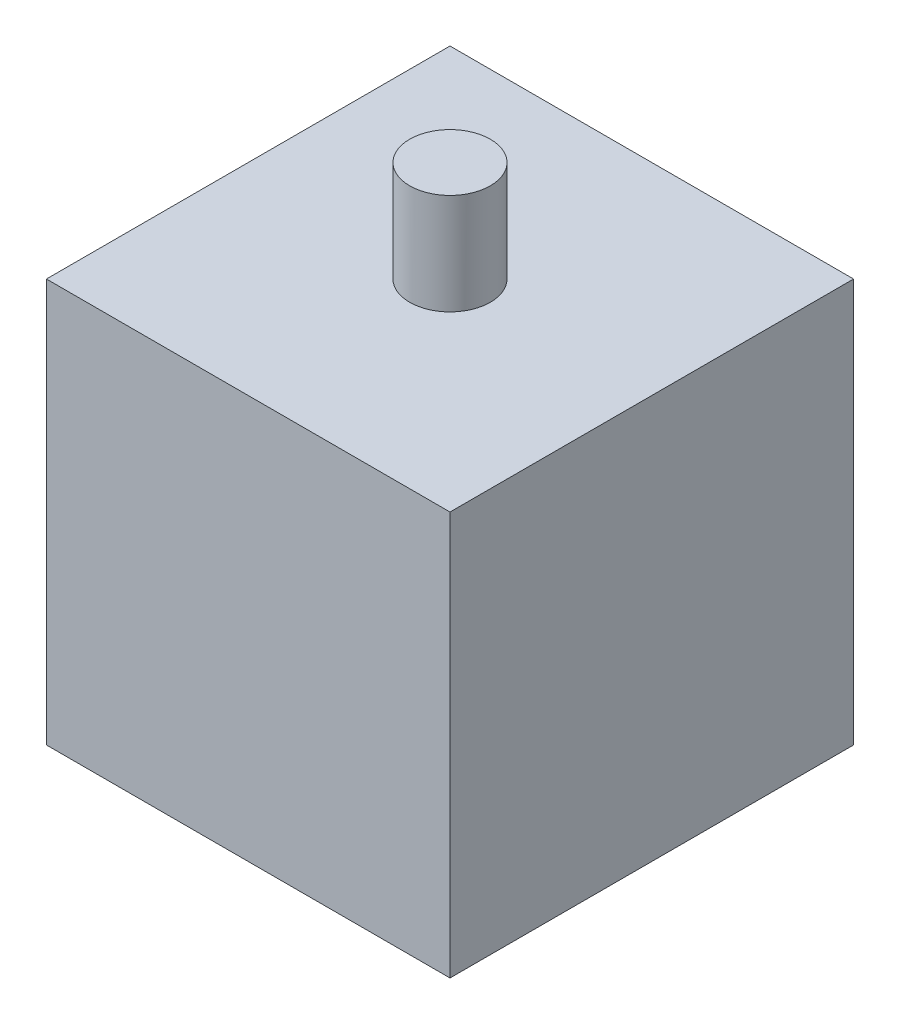
ISO-10303-21;
HEADER;
FILE_DESCRIPTION(('STEP AP214'),'2;1');
FILE_NAME('part.step','',(''),(''),'','','');
FILE_SCHEMA(('AUTOMOTIVE_DESIGN { 1 0 10303 214 1 1 1 1 }'));
ENDSEC;
DATA;
#1=APPLICATION_CONTEXT('core data for automotive mechanical design processes');
#2=APPLICATION_PROTOCOL_DEFINITION('international standard','automotive_design',2000,#1);
#3=PRODUCT_CONTEXT('',#1,'mechanical');
#4=PRODUCT('Part','Part','',(#3));
#5=PRODUCT_RELATED_PRODUCT_CATEGORY('part','',(#4));
#6=PRODUCT_DEFINITION_FORMATION('','',#4);
#7=PRODUCT_DEFINITION_CONTEXT('part definition',#1,'design');
#8=PRODUCT_DEFINITION('design','',#6,#7);
#9=PRODUCT_DEFINITION_SHAPE('','',#8);
#10=(LENGTH_UNIT() NAMED_UNIT(*) SI_UNIT(.MILLI.,.METRE.));
#11=(NAMED_UNIT(*) PLANE_ANGLE_UNIT() SI_UNIT($,.RADIAN.));
#12=(NAMED_UNIT(*) SI_UNIT($,.STERADIAN.) SOLID_ANGLE_UNIT());
#13=UNCERTAINTY_MEASURE_WITH_UNIT(LENGTH_MEASURE(1.E-05),#10,'distance_accuracy_value','');
#14=(GEOMETRIC_REPRESENTATION_CONTEXT(3) GLOBAL_UNCERTAINTY_ASSIGNED_CONTEXT((#13)) GLOBAL_UNIT_ASSIGNED_CONTEXT((#10,
#11,#12)) REPRESENTATION_CONTEXT('',''));
#15=CARTESIAN_POINT('',(0.,0.,0.));
#16=DIRECTION('',(0.,0.,1.));
#17=DIRECTION('',(1.,0.,0.));
#18=AXIS2_PLACEMENT_3D('',#15,#16,#17);
#19=CARTESIAN_POINT('',(0.,100.,0.));
#20=DIRECTION('',(1.,0.,0.));
#21=DIRECTION('',(0.,0.,-1.));
#22=AXIS2_PLACEMENT_3D('',#19,#20,#21);
#23=PLANE('',#22);
#24=DIRECTION('',(0.,0.,1.));
#25=VECTOR('',#24,1.);
#26=CARTESIAN_POINT('',(0.,0.,0.));
#27=LINE('',#26,#25);
#28=CARTESIAN_POINT('',(0.,0.,-100.));
#29=VERTEX_POINT('',#28);
#30=CARTESIAN_POINT('',(0.,0.,0.));
#31=VERTEX_POINT('',#30);
#32=EDGE_CURVE('E107',#29,#31,#27,.T.);
#33=ORIENTED_EDGE('',*,*,#32,.T.);
#34=DIRECTION('',(0.,-1.,0.));
#35=VECTOR('',#34,1.);
#36=CARTESIAN_POINT('',(0.,100.,0.));
#37=LINE('',#36,#35);
#38=CARTESIAN_POINT('',(0.,100.,0.));
#39=VERTEX_POINT('',#38);
#40=EDGE_CURVE('E49',#39,#31,#37,.T.);
#41=ORIENTED_EDGE('',*,*,#40,.F.);
#42=DIRECTION('',(0.,0.,1.));
#43=VECTOR('',#42,1.);
#44=CARTESIAN_POINT('',(0.,100.,0.));
#45=LINE('',#44,#43);
#46=CARTESIAN_POINT('',(0.,100.,-100.));
#47=VERTEX_POINT('',#46);
#48=EDGE_CURVE('E93',#47,#39,#45,.T.);
#49=ORIENTED_EDGE('',*,*,#48,.F.);
#50=DIRECTION('',(0.,-1.,0.));
#51=VECTOR('',#50,1.);
#52=CARTESIAN_POINT('',(0.,100.,-100.));
#53=LINE('',#52,#51);
#54=EDGE_CURVE('E103',#47,#29,#53,.T.);
#55=ORIENTED_EDGE('',*,*,#54,.T.);
#56=EDGE_LOOP('',(#33,#41,#49,#55));
#57=FACE_BOUND('',#56,.T.);
#58=ADVANCED_FACE('F41',(#57),#23,.F.);
#59=CARTESIAN_POINT('',(0.,100.,0.));
#60=DIRECTION('',(0.,0.,-1.));
#61=DIRECTION('',(-1.,0.,0.));
#62=AXIS2_PLACEMENT_3D('',#59,#60,#61);
#63=PLANE('',#62);
#64=DIRECTION('',(1.,0.,0.));
#65=VECTOR('',#64,1.);
#66=CARTESIAN_POINT('',(0.,0.,0.));
#67=LINE('',#66,#65);
#68=CARTESIAN_POINT('',(100.,0.,0.));
#69=VERTEX_POINT('',#68);
#70=EDGE_CURVE('E98',#31,#69,#67,.T.);
#71=ORIENTED_EDGE('',*,*,#70,.T.);
#72=DIRECTION('',(0.,-1.,0.));
#73=VECTOR('',#72,1.);
#74=CARTESIAN_POINT('',(100.,100.,0.));
#75=LINE('',#74,#73);
#76=CARTESIAN_POINT('',(100.,100.,0.));
#77=VERTEX_POINT('',#76);
#78=EDGE_CURVE('E96',#77,#69,#75,.T.);
#79=ORIENTED_EDGE('',*,*,#78,.F.);
#80=DIRECTION('',(1.,0.,0.));
#81=VECTOR('',#80,1.);
#82=CARTESIAN_POINT('',(0.,100.,0.));
#83=LINE('',#82,#81);
#84=EDGE_CURVE('E88',#39,#77,#83,.T.);
#85=ORIENTED_EDGE('',*,*,#84,.F.);
#86=ORIENTED_EDGE('',*,*,#40,.T.);
#87=EDGE_LOOP('',(#71,#79,#85,#86));
#88=FACE_BOUND('',#87,.T.);
#89=ADVANCED_FACE('F97',(#88),#63,.F.);
#90=CARTESIAN_POINT('',(100.,100.,0.));
#91=DIRECTION('',(-1.,0.,0.));
#92=DIRECTION('',(0.,0.,1.));
#93=AXIS2_PLACEMENT_3D('',#90,#91,#92);
#94=PLANE('',#93);
#95=DIRECTION('',(0.,0.,-1.));
#96=VECTOR('',#95,1.);
#97=CARTESIAN_POINT('',(100.,0.,0.));
#98=LINE('',#97,#96);
#99=CARTESIAN_POINT('',(100.,0.,-100.));
#100=VERTEX_POINT('',#99);
#101=EDGE_CURVE('E74',#69,#100,#98,.T.);
#102=ORIENTED_EDGE('',*,*,#101,.T.);
#103=DIRECTION('',(0.,-1.,0.));
#104=VECTOR('',#103,1.);
#105=CARTESIAN_POINT('',(100.,100.,-100.));
#106=LINE('',#105,#104);
#107=CARTESIAN_POINT('',(100.,100.,-100.));
#108=VERTEX_POINT('',#107);
#109=EDGE_CURVE('E99',#108,#100,#106,.T.);
#110=ORIENTED_EDGE('',*,*,#109,.F.);
#111=DIRECTION('',(0.,0.,-1.));
#112=VECTOR('',#111,1.);
#113=CARTESIAN_POINT('',(100.,100.,0.));
#114=LINE('',#113,#112);
#115=EDGE_CURVE('E91',#77,#108,#114,.T.);
#116=ORIENTED_EDGE('',*,*,#115,.F.);
#117=ORIENTED_EDGE('',*,*,#78,.T.);
#118=EDGE_LOOP('',(#102,#110,#116,#117));
#119=FACE_BOUND('',#118,.T.);
#120=ADVANCED_FACE('F101',(#119),#94,.F.);
#121=CARTESIAN_POINT('',(0.,100.,-100.));
#122=DIRECTION('',(0.,0.,1.));
#123=DIRECTION('',(1.,0.,0.));
#124=AXIS2_PLACEMENT_3D('',#121,#122,#123);
#125=PLANE('',#124);
#126=DIRECTION('',(-1.,0.,0.));
#127=VECTOR('',#126,1.);
#128=CARTESIAN_POINT('',(0.,0.,-100.));
#129=LINE('',#128,#127);
#130=EDGE_CURVE('E80',#100,#29,#129,.T.);
#131=ORIENTED_EDGE('',*,*,#130,.T.);
#132=ORIENTED_EDGE('',*,*,#54,.F.);
#133=DIRECTION('',(-1.,0.,0.));
#134=VECTOR('',#133,1.);
#135=CARTESIAN_POINT('',(0.,100.,-100.));
#136=LINE('',#135,#134);
#137=EDGE_CURVE('E57',#108,#47,#136,.T.);
#138=ORIENTED_EDGE('',*,*,#137,.F.);
#139=ORIENTED_EDGE('',*,*,#109,.T.);
#140=EDGE_LOOP('',(#131,#132,#138,#139));
#141=FACE_BOUND('',#140,.T.);
#142=ADVANCED_FACE('F130',(#141),#125,.F.);
#143=CARTESIAN_POINT('',(0.,100.,0.));
#144=DIRECTION('',(0.,-1.,0.));
#145=DIRECTION('',(0.,0.,-1.));
#146=AXIS2_PLACEMENT_3D('',#143,#144,#145);
#147=PLANE('',#146);
#148=CARTESIAN_POINT('',(50.,100.,-50.));
#149=DIRECTION('',(0.,-1.,0.));
#150=DIRECTION('',(0.,0.,-1.));
#151=AXIS2_PLACEMENT_3D('',#148,#149,#150);
#152=CIRCLE('',#151,10.);
#153=CARTESIAN_POINT('',(50.,100.,-60.));
#154=VERTEX_POINT('',#153);
#155=EDGE_CURVE('E11',#154,#154,#152,.F.);
#156=ORIENTED_EDGE('',*,*,#155,.F.);
#157=EDGE_LOOP('',(#156));
#158=FACE_BOUND('',#157,.T.);
#159=ORIENTED_EDGE('',*,*,#48,.T.);
#160=ORIENTED_EDGE('',*,*,#84,.T.);
#161=ORIENTED_EDGE('',*,*,#115,.T.);
#162=ORIENTED_EDGE('',*,*,#137,.T.);
#163=EDGE_LOOP('',(#159,#160,#161,#162));
#164=FACE_BOUND('',#163,.T.);
#165=ADVANCED_FACE('F89',(#158,#164),#147,.F.);
#166=CARTESIAN_POINT('',(0.,0.,0.));
#167=DIRECTION('',(0.,-1.,0.));
#168=DIRECTION('',(0.,0.,-1.));
#169=AXIS2_PLACEMENT_3D('',#166,#167,#168);
#170=PLANE('',#169);
#171=ORIENTED_EDGE('',*,*,#32,.F.);
#172=ORIENTED_EDGE('',*,*,#130,.F.);
#173=ORIENTED_EDGE('',*,*,#101,.F.);
#174=ORIENTED_EDGE('',*,*,#70,.F.);
#175=EDGE_LOOP('',(#171,#172,#173,#174));
#176=FACE_BOUND('',#175,.T.);
#177=ADVANCED_FACE('F118',(#176),#170,.T.);
#178=CARTESIAN_POINT('',(50.,125.,-50.));
#179=DIRECTION('',(0.,-1.,0.));
#180=DIRECTION('',(0.,0.,-1.));
#181=AXIS2_PLACEMENT_3D('',#178,#179,#180);
#182=CYLINDRICAL_SURFACE('',#181,10.);
#183=CARTESIAN_POINT('',(50.,125.,-50.));
#184=DIRECTION('',(0.,1.,0.));
#185=DIRECTION('',(0.,0.,1.));
#186=AXIS2_PLACEMENT_3D('',#183,#184,#185);
#187=CIRCLE('',#186,10.);
#188=CARTESIAN_POINT('',(50.,125.,-40.));
#189=VERTEX_POINT('',#188);
#190=EDGE_CURVE('E110',#189,#189,#187,.T.);
#191=ORIENTED_EDGE('',*,*,#190,.F.);
#192=EDGE_LOOP('',(#191));
#193=FACE_BOUND('',#192,.T.);
#194=ORIENTED_EDGE('',*,*,#155,.T.);
#195=EDGE_LOOP('',(#194));
#196=FACE_BOUND('',#195,.T.);
#197=ADVANCED_FACE('F120',(#193,#196),#182,.T.);
#198=CARTESIAN_POINT('',(50.,125.,-50.));
#199=DIRECTION('',(0.,1.,0.));
#200=DIRECTION('',(0.,0.,1.));
#201=AXIS2_PLACEMENT_3D('',#198,#199,#200);
#202=PLANE('',#201);
#203=ORIENTED_EDGE('',*,*,#190,.T.);
#204=EDGE_LOOP('',(#203));
#205=FACE_BOUND('',#204,.T.);
#206=ADVANCED_FACE('F127',(#205),#202,.T.);
#207=CLOSED_SHELL('',(#58,#89,#120,#142,#165,#177,#197,#206));
#208=MANIFOLD_SOLID_BREP('B2',#207);
#209=ADVANCED_BREP_SHAPE_REPRESENTATION('',(#18,#208),#14);
#210=SHAPE_DEFINITION_REPRESENTATION(#9,#209);
ENDSEC;
END-ISO-10303-21;
